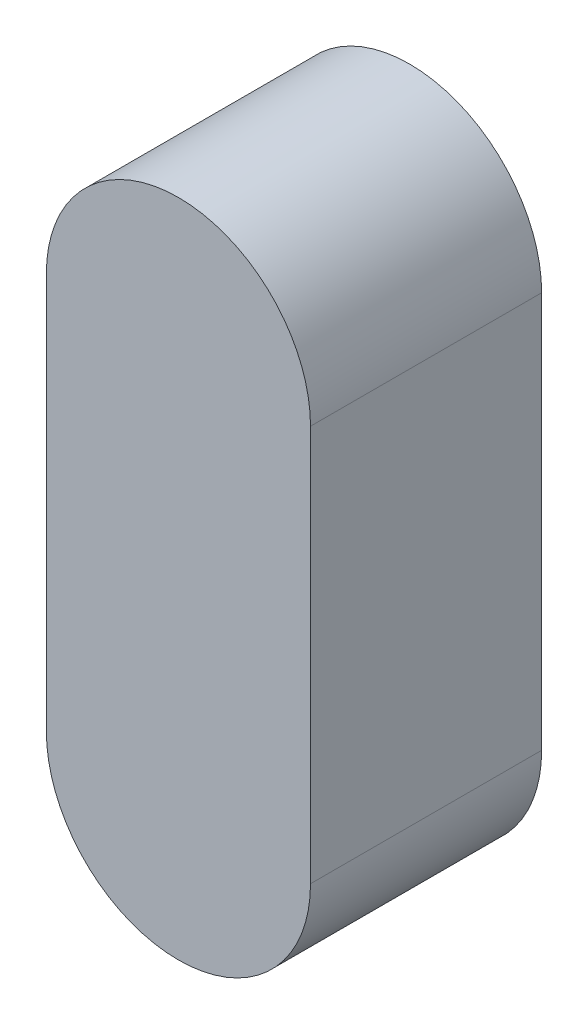
ISO-10303-21;
HEADER;
FILE_DESCRIPTION(('STEP AP214'),'2;1');
FILE_NAME('part.step','',(''),(''),'','','');
FILE_SCHEMA(('AUTOMOTIVE_DESIGN { 1 0 10303 214 1 1 1 1 }'));
ENDSEC;
DATA;
#1=APPLICATION_CONTEXT('core data for automotive mechanical design processes');
#2=APPLICATION_PROTOCOL_DEFINITION('international standard','automotive_design',2000,#1);
#3=PRODUCT_CONTEXT('',#1,'mechanical');
#4=PRODUCT('Part','Part','',(#3));
#5=PRODUCT_RELATED_PRODUCT_CATEGORY('part','',(#4));
#6=PRODUCT_DEFINITION_FORMATION('','',#4);
#7=PRODUCT_DEFINITION_CONTEXT('part definition',#1,'design');
#8=PRODUCT_DEFINITION('design','',#6,#7);
#9=PRODUCT_DEFINITION_SHAPE('','',#8);
#10=(LENGTH_UNIT() NAMED_UNIT(*) SI_UNIT(.MILLI.,.METRE.));
#11=(NAMED_UNIT(*) PLANE_ANGLE_UNIT() SI_UNIT($,.RADIAN.));
#12=(NAMED_UNIT(*) SI_UNIT($,.STERADIAN.) SOLID_ANGLE_UNIT());
#13=UNCERTAINTY_MEASURE_WITH_UNIT(LENGTH_MEASURE(1.E-05),#10,'distance_accuracy_value','');
#14=(GEOMETRIC_REPRESENTATION_CONTEXT(3) GLOBAL_UNCERTAINTY_ASSIGNED_CONTEXT((#13)) GLOBAL_UNIT_ASSIGNED_CONTEXT((#10,
#11,#12)) REPRESENTATION_CONTEXT('',''));
#15=CARTESIAN_POINT('',(0.,0.,0.));
#16=DIRECTION('',(0.,0.,1.));
#17=DIRECTION('',(1.,0.,0.));
#18=AXIS2_PLACEMENT_3D('',#15,#16,#17);
#19=CARTESIAN_POINT('',(0.,0.,7.));
#20=DIRECTION('',(0.,0.,-1.));
#21=DIRECTION('',(-1.,0.,0.));
#22=AXIS2_PLACEMENT_3D('',#19,#20,#21);
#23=CYLINDRICAL_SURFACE('',#22,4.);
#24=CARTESIAN_POINT('',(0.,0.,0.));
#25=DIRECTION('',(0.,0.,1.));
#26=DIRECTION('',(1.,0.,0.));
#27=AXIS2_PLACEMENT_3D('',#24,#25,#26);
#28=CIRCLE('',#27,4.);
#29=CARTESIAN_POINT('',(-4.,0.,0.));
#30=VERTEX_POINT('',#29);
#31=CARTESIAN_POINT('',(4.,0.,0.));
#32=VERTEX_POINT('',#31);
#33=EDGE_CURVE('E113',#30,#32,#28,.T.);
#34=ORIENTED_EDGE('',*,*,#33,.T.);
#35=DIRECTION('',(0.,0.,-1.));
#36=VECTOR('',#35,1.);
#37=CARTESIAN_POINT('',(4.,0.,7.));
#38=LINE('',#37,#36);
#39=CARTESIAN_POINT('',(4.,0.,7.));
#40=VERTEX_POINT('',#39);
#41=EDGE_CURVE('E11',#40,#32,#38,.T.);
#42=ORIENTED_EDGE('',*,*,#41,.F.);
#43=CARTESIAN_POINT('',(0.,0.,7.));
#44=DIRECTION('',(0.,0.,1.));
#45=DIRECTION('',(1.,0.,0.));
#46=AXIS2_PLACEMENT_3D('',#43,#44,#45);
#47=CIRCLE('',#46,4.);
#48=CARTESIAN_POINT('',(-4.,0.,7.));
#49=VERTEX_POINT('',#48);
#50=EDGE_CURVE('E97',#49,#40,#47,.T.);
#51=ORIENTED_EDGE('',*,*,#50,.F.);
#52=DIRECTION('',(0.,0.,-1.));
#53=VECTOR('',#52,1.);
#54=CARTESIAN_POINT('',(-4.,0.,7.));
#55=LINE('',#54,#53);
#56=EDGE_CURVE('E109',#49,#30,#55,.T.);
#57=ORIENTED_EDGE('',*,*,#56,.T.);
#58=EDGE_LOOP('',(#34,#42,#51,#57));
#59=FACE_BOUND('',#58,.T.);
#60=ADVANCED_FACE('F45',(#59),#23,.T.);
#61=CARTESIAN_POINT('',(4.,0.,7.));
#62=DIRECTION('',(-1.,0.,0.));
#63=DIRECTION('',(0.,0.,1.));
#64=AXIS2_PLACEMENT_3D('',#61,#62,#63);
#65=PLANE('',#64);
#66=DIRECTION('',(0.,1.,0.));
#67=VECTOR('',#66,1.);
#68=CARTESIAN_POINT('',(4.,0.,0.));
#69=LINE('',#68,#67);
#70=CARTESIAN_POINT('',(4.,12.,0.));
#71=VERTEX_POINT('',#70);
#72=EDGE_CURVE('E102',#32,#71,#69,.T.);
#73=ORIENTED_EDGE('',*,*,#72,.T.);
#74=DIRECTION('',(0.,0.,-1.));
#75=VECTOR('',#74,1.);
#76=CARTESIAN_POINT('',(4.,12.,7.));
#77=LINE('',#76,#75);
#78=CARTESIAN_POINT('',(4.,12.,7.));
#79=VERTEX_POINT('',#78);
#80=EDGE_CURVE('E54',#79,#71,#77,.T.);
#81=ORIENTED_EDGE('',*,*,#80,.F.);
#82=DIRECTION('',(0.,1.,0.));
#83=VECTOR('',#82,1.);
#84=CARTESIAN_POINT('',(4.,0.,7.));
#85=LINE('',#84,#83);
#86=EDGE_CURVE('E92',#40,#79,#85,.T.);
#87=ORIENTED_EDGE('',*,*,#86,.F.);
#88=ORIENTED_EDGE('',*,*,#41,.T.);
#89=EDGE_LOOP('',(#73,#81,#87,#88));
#90=FACE_BOUND('',#89,.T.);
#91=ADVANCED_FACE('F101',(#90),#65,.F.);
#92=CARTESIAN_POINT('',(0.,12.,7.));
#93=DIRECTION('',(0.,0.,-1.));
#94=DIRECTION('',(-1.,0.,0.));
#95=AXIS2_PLACEMENT_3D('',#92,#93,#94);
#96=CYLINDRICAL_SURFACE('',#95,4.);
#97=CARTESIAN_POINT('',(0.,12.,0.));
#98=DIRECTION('',(0.,0.,1.));
#99=DIRECTION('',(1.,0.,0.));
#100=AXIS2_PLACEMENT_3D('',#97,#98,#99);
#101=CIRCLE('',#100,4.);
#102=CARTESIAN_POINT('',(-4.,12.,0.));
#103=VERTEX_POINT('',#102);
#104=EDGE_CURVE('E79',#71,#103,#101,.T.);
#105=ORIENTED_EDGE('',*,*,#104,.T.);
#106=DIRECTION('',(0.,0.,-1.));
#107=VECTOR('',#106,1.);
#108=CARTESIAN_POINT('',(-4.,12.,7.));
#109=LINE('',#108,#107);
#110=CARTESIAN_POINT('',(-4.,12.,7.));
#111=VERTEX_POINT('',#110);
#112=EDGE_CURVE('E104',#111,#103,#109,.T.);
#113=ORIENTED_EDGE('',*,*,#112,.F.);
#114=CARTESIAN_POINT('',(0.,12.,7.));
#115=DIRECTION('',(0.,0.,1.));
#116=DIRECTION('',(1.,0.,0.));
#117=AXIS2_PLACEMENT_3D('',#114,#115,#116);
#118=CIRCLE('',#117,4.);
#119=EDGE_CURVE('E95',#79,#111,#118,.T.);
#120=ORIENTED_EDGE('',*,*,#119,.F.);
#121=ORIENTED_EDGE('',*,*,#80,.T.);
#122=EDGE_LOOP('',(#105,#113,#120,#121));
#123=FACE_BOUND('',#122,.T.);
#124=ADVANCED_FACE('F105',(#123),#96,.T.);
#125=CARTESIAN_POINT('',(-4.,0.,7.));
#126=DIRECTION('',(1.,0.,0.));
#127=DIRECTION('',(0.,0.,-1.));
#128=AXIS2_PLACEMENT_3D('',#125,#126,#127);
#129=PLANE('',#128);
#130=DIRECTION('',(0.,-1.,0.));
#131=VECTOR('',#130,1.);
#132=CARTESIAN_POINT('',(-4.,0.,0.));
#133=LINE('',#132,#131);
#134=EDGE_CURVE('E85',#103,#30,#133,.T.);
#135=ORIENTED_EDGE('',*,*,#134,.T.);
#136=ORIENTED_EDGE('',*,*,#56,.F.);
#137=DIRECTION('',(0.,-1.,0.));
#138=VECTOR('',#137,1.);
#139=CARTESIAN_POINT('',(-4.,0.,7.));
#140=LINE('',#139,#138);
#141=EDGE_CURVE('E62',#111,#49,#140,.T.);
#142=ORIENTED_EDGE('',*,*,#141,.F.);
#143=ORIENTED_EDGE('',*,*,#112,.T.);
#144=EDGE_LOOP('',(#135,#136,#142,#143));
#145=FACE_BOUND('',#144,.T.);
#146=ADVANCED_FACE('F126',(#145),#129,.F.);
#147=CARTESIAN_POINT('',(0.,0.,7.));
#148=DIRECTION('',(0.,0.,1.));
#149=DIRECTION('',(1.,0.,0.));
#150=AXIS2_PLACEMENT_3D('',#147,#148,#149);
#151=PLANE('',#150);
#152=ORIENTED_EDGE('',*,*,#50,.T.);
#153=ORIENTED_EDGE('',*,*,#86,.T.);
#154=ORIENTED_EDGE('',*,*,#119,.T.);
#155=ORIENTED_EDGE('',*,*,#141,.T.);
#156=EDGE_LOOP('',(#152,#153,#154,#155));
#157=FACE_BOUND('',#156,.T.);
#158=ADVANCED_FACE('F93',(#157),#151,.T.);
#159=CARTESIAN_POINT('',(0.,0.,0.));
#160=DIRECTION('',(0.,0.,1.));
#161=DIRECTION('',(1.,0.,0.));
#162=AXIS2_PLACEMENT_3D('',#159,#160,#161);
#163=PLANE('',#162);
#164=ORIENTED_EDGE('',*,*,#33,.F.);
#165=ORIENTED_EDGE('',*,*,#134,.F.);
#166=ORIENTED_EDGE('',*,*,#104,.F.);
#167=ORIENTED_EDGE('',*,*,#72,.F.);
#168=EDGE_LOOP('',(#164,#165,#166,#167));
#169=FACE_BOUND('',#168,.T.);
#170=ADVANCED_FACE('F129',(#169),#163,.F.);
#171=CLOSED_SHELL('',(#60,#91,#124,#146,#158,#170));
#172=MANIFOLD_SOLID_BREP('B2',#171);
#173=ADVANCED_BREP_SHAPE_REPRESENTATION('',(#18,#172),#14);
#174=SHAPE_DEFINITION_REPRESENTATION(#9,#173);
ENDSEC;
END-ISO-10303-21;
